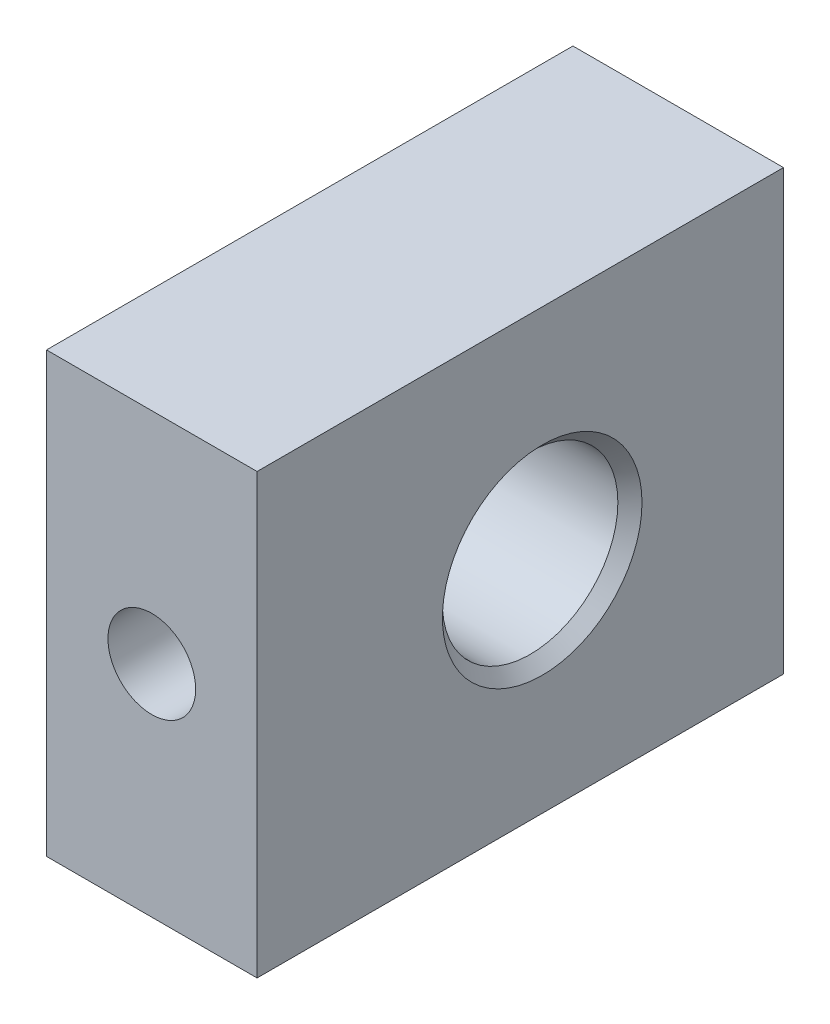
ISO-10303-21;
HEADER;
FILE_DESCRIPTION(('STEP AP214'),'2;1');
FILE_NAME('part.step','',(''),(''),'','','');
FILE_SCHEMA(('AUTOMOTIVE_DESIGN { 1 0 10303 214 1 1 1 1 }'));
ENDSEC;
DATA;
#1=APPLICATION_CONTEXT('core data for automotive mechanical design processes');
#2=APPLICATION_PROTOCOL_DEFINITION('international standard','automotive_design',2000,#1);
#3=PRODUCT_CONTEXT('',#1,'mechanical');
#4=PRODUCT('Part','Part','',(#3));
#5=PRODUCT_RELATED_PRODUCT_CATEGORY('part','',(#4));
#6=PRODUCT_DEFINITION_FORMATION('','',#4);
#7=PRODUCT_DEFINITION_CONTEXT('part definition',#1,'design');
#8=PRODUCT_DEFINITION('design','',#6,#7);
#9=PRODUCT_DEFINITION_SHAPE('','',#8);
#10=(LENGTH_UNIT() NAMED_UNIT(*) SI_UNIT(.MILLI.,.METRE.));
#11=(NAMED_UNIT(*) PLANE_ANGLE_UNIT() SI_UNIT($,.RADIAN.));
#12=(NAMED_UNIT(*) SI_UNIT($,.STERADIAN.) SOLID_ANGLE_UNIT());
#13=UNCERTAINTY_MEASURE_WITH_UNIT(LENGTH_MEASURE(1.E-05),#10,'distance_accuracy_value','');
#14=(GEOMETRIC_REPRESENTATION_CONTEXT(3) GLOBAL_UNCERTAINTY_ASSIGNED_CONTEXT((#13)) GLOBAL_UNIT_ASSIGNED_CONTEXT((#10,
#11,#12)) REPRESENTATION_CONTEXT('',''));
#15=CARTESIAN_POINT('',(0.,0.,0.));
#16=DIRECTION('',(0.,0.,1.));
#17=DIRECTION('',(1.,0.,0.));
#18=AXIS2_PLACEMENT_3D('',#15,#16,#17);
#19=CARTESIAN_POINT('',(2.4,-5.,12.));
#20=DIRECTION('',(-1.,0.,0.));
#21=DIRECTION('',(0.,0.,1.));
#22=AXIS2_PLACEMENT_3D('',#19,#20,#21);
#23=PLANE('',#22);
#24=CARTESIAN_POINT('',(2.4,0.,5.5));
#25=DIRECTION('',(1.,0.,0.));
#26=DIRECTION('',(0.,0.,-1.));
#27=AXIS2_PLACEMENT_3D('',#24,#25,#26);
#28=CIRCLE('',#27,2.275);
#29=CARTESIAN_POINT('',(2.4,0.,3.225));
#30=VERTEX_POINT('',#29);
#31=EDGE_CURVE('E113',#30,#30,#28,.T.);
#32=ORIENTED_EDGE('',*,*,#31,.F.);
#33=EDGE_LOOP('',(#32));
#34=FACE_BOUND('',#33,.T.);
#35=DIRECTION('',(0.,1.,0.));
#36=VECTOR('',#35,1.);
#37=CARTESIAN_POINT('',(2.4,-5.,0.));
#38=LINE('',#37,#36);
#39=CARTESIAN_POINT('',(2.4,-5.,0.));
#40=VERTEX_POINT('',#39);
#41=CARTESIAN_POINT('',(2.4,5.,0.));
#42=VERTEX_POINT('',#41);
#43=EDGE_CURVE('E94',#40,#42,#38,.T.);
#44=ORIENTED_EDGE('',*,*,#43,.T.);
#45=DIRECTION('',(0.,0.,-1.));
#46=VECTOR('',#45,1.);
#47=CARTESIAN_POINT('',(2.4,5.,12.));
#48=LINE('',#47,#46);
#49=CARTESIAN_POINT('',(2.4,5.,12.));
#50=VERTEX_POINT('',#49);
#51=EDGE_CURVE('E11',#50,#42,#48,.T.);
#52=ORIENTED_EDGE('',*,*,#51,.F.);
#53=DIRECTION('',(0.,1.,0.));
#54=VECTOR('',#53,1.);
#55=CARTESIAN_POINT('',(2.4,-5.,12.));
#56=LINE('',#55,#54);
#57=CARTESIAN_POINT('',(2.4,-5.,12.));
#58=VERTEX_POINT('',#57);
#59=EDGE_CURVE('E82',#58,#50,#56,.T.);
#60=ORIENTED_EDGE('',*,*,#59,.F.);
#61=DIRECTION('',(0.,0.,-1.));
#62=VECTOR('',#61,1.);
#63=CARTESIAN_POINT('',(2.4,-5.,12.));
#64=LINE('',#63,#62);
#65=EDGE_CURVE('E90',#58,#40,#64,.T.);
#66=ORIENTED_EDGE('',*,*,#65,.T.);
#67=EDGE_LOOP('',(#44,#52,#60,#66));
#68=FACE_BOUND('',#67,.T.);
#69=ADVANCED_FACE('F31',(#34,#68),#23,.F.);
#70=CARTESIAN_POINT('',(-2.4,5.,12.));
#71=DIRECTION('',(0.,-1.,0.));
#72=DIRECTION('',(0.,0.,-1.));
#73=AXIS2_PLACEMENT_3D('',#70,#71,#72);
#74=PLANE('',#73);
#75=DIRECTION('',(-1.,0.,0.));
#76=VECTOR('',#75,1.);
#77=CARTESIAN_POINT('',(-2.4,5.,0.));
#78=LINE('',#77,#76);
#79=CARTESIAN_POINT('',(-2.4,5.,0.));
#80=VERTEX_POINT('',#79);
#81=EDGE_CURVE('E86',#42,#80,#78,.T.);
#82=ORIENTED_EDGE('',*,*,#81,.T.);
#83=DIRECTION('',(0.,0.,-1.));
#84=VECTOR('',#83,1.);
#85=CARTESIAN_POINT('',(-2.4,5.,12.));
#86=LINE('',#85,#84);
#87=CARTESIAN_POINT('',(-2.4,5.,12.));
#88=VERTEX_POINT('',#87);
#89=EDGE_CURVE('E39',#88,#80,#86,.T.);
#90=ORIENTED_EDGE('',*,*,#89,.F.);
#91=DIRECTION('',(-1.,0.,0.));
#92=VECTOR('',#91,1.);
#93=CARTESIAN_POINT('',(-2.4,5.,12.));
#94=LINE('',#93,#92);
#95=EDGE_CURVE('E77',#50,#88,#94,.T.);
#96=ORIENTED_EDGE('',*,*,#95,.F.);
#97=ORIENTED_EDGE('',*,*,#51,.T.);
#98=EDGE_LOOP('',(#82,#90,#96,#97));
#99=FACE_BOUND('',#98,.T.);
#100=ADVANCED_FACE('F85',(#99),#74,.F.);
#101=CARTESIAN_POINT('',(-2.4,-5.,12.));
#102=DIRECTION('',(1.,0.,0.));
#103=DIRECTION('',(0.,0.,-1.));
#104=AXIS2_PLACEMENT_3D('',#101,#102,#103);
#105=PLANE('',#104);
#106=CARTESIAN_POINT('',(-2.4,0.,5.5));
#107=DIRECTION('',(1.,0.,0.));
#108=DIRECTION('',(0.,0.,-1.));
#109=AXIS2_PLACEMENT_3D('',#106,#107,#108);
#110=CIRCLE('',#109,2.275);
#111=CARTESIAN_POINT('',(-2.4,0.,3.225));
#112=VERTEX_POINT('',#111);
#113=EDGE_CURVE('E116',#112,#112,#110,.T.);
#114=ORIENTED_EDGE('',*,*,#113,.T.);
#115=EDGE_LOOP('',(#114));
#116=FACE_BOUND('',#115,.T.);
#117=DIRECTION('',(0.,-1.,0.));
#118=VECTOR('',#117,1.);
#119=CARTESIAN_POINT('',(-2.4,-5.,0.));
#120=LINE('',#119,#118);
#121=CARTESIAN_POINT('',(-2.4,-5.,0.));
#122=VERTEX_POINT('',#121);
#123=EDGE_CURVE('E64',#80,#122,#120,.T.);
#124=ORIENTED_EDGE('',*,*,#123,.T.);
#125=DIRECTION('',(0.,0.,-1.));
#126=VECTOR('',#125,1.);
#127=CARTESIAN_POINT('',(-2.4,-5.,12.));
#128=LINE('',#127,#126);
#129=CARTESIAN_POINT('',(-2.4,-5.,12.));
#130=VERTEX_POINT('',#129);
#131=EDGE_CURVE('E87',#130,#122,#128,.T.);
#132=ORIENTED_EDGE('',*,*,#131,.F.);
#133=DIRECTION('',(0.,-1.,0.));
#134=VECTOR('',#133,1.);
#135=CARTESIAN_POINT('',(-2.4,-5.,12.));
#136=LINE('',#135,#134);
#137=EDGE_CURVE('E80',#88,#130,#136,.T.);
#138=ORIENTED_EDGE('',*,*,#137,.F.);
#139=ORIENTED_EDGE('',*,*,#89,.T.);
#140=EDGE_LOOP('',(#124,#132,#138,#139));
#141=FACE_BOUND('',#140,.T.);
#142=ADVANCED_FACE('F88',(#116,#141),#105,.F.);
#143=CARTESIAN_POINT('',(-2.4,-5.,12.));
#144=DIRECTION('',(0.,1.,0.));
#145=DIRECTION('',(0.,0.,1.));
#146=AXIS2_PLACEMENT_3D('',#143,#144,#145);
#147=PLANE('',#146);
#148=DIRECTION('',(1.,0.,0.));
#149=VECTOR('',#148,1.);
#150=CARTESIAN_POINT('',(-2.4,-5.,0.));
#151=LINE('',#150,#149);
#152=EDGE_CURVE('E70',#122,#40,#151,.T.);
#153=ORIENTED_EDGE('',*,*,#152,.T.);
#154=ORIENTED_EDGE('',*,*,#65,.F.);
#155=DIRECTION('',(1.,0.,0.));
#156=VECTOR('',#155,1.);
#157=CARTESIAN_POINT('',(-2.4,-5.,12.));
#158=LINE('',#157,#156);
#159=EDGE_CURVE('E47',#130,#58,#158,.T.);
#160=ORIENTED_EDGE('',*,*,#159,.F.);
#161=ORIENTED_EDGE('',*,*,#131,.T.);
#162=EDGE_LOOP('',(#153,#154,#160,#161));
#163=FACE_BOUND('',#162,.T.);
#164=ADVANCED_FACE('F102',(#163),#147,.F.);
#165=CARTESIAN_POINT('',(2.4,5.,12.));
#166=DIRECTION('',(0.,0.,-1.));
#167=DIRECTION('',(-1.,0.,0.));
#168=AXIS2_PLACEMENT_3D('',#165,#166,#167);
#169=PLANE('',#168);
#170=CARTESIAN_POINT('',(0.,0.,12.));
#171=DIRECTION('',(0.,0.,1.));
#172=DIRECTION('',(1.,0.,0.));
#173=AXIS2_PLACEMENT_3D('',#170,#171,#172);
#174=CIRCLE('',#173,1.);
#175=CARTESIAN_POINT('',(1.,0.,12.));
#176=VERTEX_POINT('',#175);
#177=EDGE_CURVE('E119',#176,#176,#174,.T.);
#178=ORIENTED_EDGE('',*,*,#177,.F.);
#179=EDGE_LOOP('',(#178));
#180=FACE_BOUND('',#179,.T.);
#181=ORIENTED_EDGE('',*,*,#59,.T.);
#182=ORIENTED_EDGE('',*,*,#95,.T.);
#183=ORIENTED_EDGE('',*,*,#137,.T.);
#184=ORIENTED_EDGE('',*,*,#159,.T.);
#185=EDGE_LOOP('',(#181,#182,#183,#184));
#186=FACE_BOUND('',#185,.T.);
#187=ADVANCED_FACE('F78',(#180,#186),#169,.F.);
#188=CARTESIAN_POINT('',(2.4,5.,0.));
#189=DIRECTION('',(0.,0.,-1.));
#190=DIRECTION('',(-1.,0.,0.));
#191=AXIS2_PLACEMENT_3D('',#188,#189,#190);
#192=PLANE('',#191);
#193=ORIENTED_EDGE('',*,*,#43,.F.);
#194=ORIENTED_EDGE('',*,*,#152,.F.);
#195=ORIENTED_EDGE('',*,*,#123,.F.);
#196=ORIENTED_EDGE('',*,*,#81,.F.);
#197=EDGE_LOOP('',(#193,#194,#195,#196));
#198=FACE_BOUND('',#197,.T.);
#199=ADVANCED_FACE('F105',(#198),#192,.T.);
#200=CARTESIAN_POINT('',(-2.125,0.,5.5));
#201=DIRECTION('',(-1.,0.,0.));
#202=DIRECTION('',(0.,0.,1.));
#203=AXIS2_PLACEMENT_3D('',#200,#201,#202);
#204=CONICAL_SURFACE('',#203,2.,0.785398163397448);
#205=ORIENTED_EDGE('',*,*,#113,.F.);
#206=EDGE_LOOP('',(#205));
#207=FACE_BOUND('',#206,.T.);
#208=CARTESIAN_POINT('',(-2.125,0.,5.5));
#209=DIRECTION('',(1.,0.,0.));
#210=DIRECTION('',(0.,0.,-1.));
#211=AXIS2_PLACEMENT_3D('',#208,#209,#210);
#212=CIRCLE('',#211,2.);
#213=CARTESIAN_POINT('',(-2.125,0.,3.5));
#214=VERTEX_POINT('',#213);
#215=EDGE_CURVE('E97',#214,#214,#212,.T.);
#216=ORIENTED_EDGE('',*,*,#215,.T.);
#217=EDGE_LOOP('',(#216));
#218=FACE_BOUND('',#217,.T.);
#219=ADVANCED_FACE('F141',(#207,#218),#204,.F.);
#220=CARTESIAN_POINT('',(2.4,0.,5.5));
#221=DIRECTION('',(1.,0.,0.));
#222=DIRECTION('',(0.,0.,-1.));
#223=AXIS2_PLACEMENT_3D('',#220,#221,#222);
#224=CYLINDRICAL_SURFACE('',#223,1.99999999999999);
#225=CARTESIAN_POINT('',(1.,0.,7.49999999999999));
#226=CARTESIAN_POINT('',(0.999996697680499,-0.0525719629529865,7.4999971340415));
#227=CARTESIAN_POINT('',(0.995829926878325,-0.105206599698033,7.49790491019517));
#228=CARTESIAN_POINT('',(0.979347119659082,-0.208920235268425,7.48974156037395));
#229=CARTESIAN_POINT('',(0.96701560700235,-0.259996086713504,7.48366287828983));
#230=CARTESIAN_POINT('',(0.934806191383206,-0.358933544880574,7.46816279403311));
#231=CARTESIAN_POINT('',(0.914957615751988,-0.40680680293918,7.4587543917752));
#232=CARTESIAN_POINT('',(0.86842937863506,-0.498472616806565,7.43745776515778));
#233=CARTESIAN_POINT('',(0.841750255751148,-0.54226549399005,7.42556973633529));
#234=CARTESIAN_POINT('',(0.780482750514702,-0.627507817761919,7.39956258258056));
#235=CARTESIAN_POINT('',(0.745513520760358,-0.668655211122112,7.38535199127535));
#236=CARTESIAN_POINT('',(0.669478520752967,-0.744779444866977,7.35659970246744));
#237=CARTESIAN_POINT('',(0.62840814822756,-0.779751583106766,7.34205776209034));
#238=CARTESIAN_POINT('',(0.537516650476618,-0.845252000450278,7.31298951197346));
#239=CARTESIAN_POINT('',(0.487263901654087,-0.875225335551637,7.29855186970131));
#240=CARTESIAN_POINT('',(0.381632664013785,-0.926168226890695,7.2728597877232));
#241=CARTESIAN_POINT('',(0.326257871277251,-0.947144214966334,7.26160307606989));
#242=CARTESIAN_POINT('',(0.215334894578077,-0.978132442188589,7.24457867037808));
#243=CARTESIAN_POINT('',(0.159995547932606,-0.988725857080441,7.23852271583713));
#244=CARTESIAN_POINT('',(0.0480211622205232,-1.00042699330885,7.23181889948527));
#245=CARTESIAN_POINT('',(-0.00861254087115467,-1.00154408837307,7.23116569343287));
#246=CARTESIAN_POINT('',(-0.114286024315368,-0.994687287172294,7.23510930257248));
#247=CARTESIAN_POINT('',(-0.16342403122305,-0.987784559536821,7.23908763662013));
#248=CARTESIAN_POINT('',(-0.259721909373042,-0.966939849056932,7.2507622873385));
#249=CARTESIAN_POINT('',(-0.306881145305315,-0.952995623897652,7.25845978831776));
#250=CARTESIAN_POINT('',(-0.399229132565659,-0.918209780386004,7.2768747641274));
#251=CARTESIAN_POINT('',(-0.444346398785788,-0.897215067115995,7.28765840663998));
#252=CARTESIAN_POINT('',(-0.530634292590007,-0.849041687668003,7.31103404281403));
#253=CARTESIAN_POINT('',(-0.571803135600088,-0.821860243812468,7.3236268478019));
#254=CARTESIAN_POINT('',(-0.654521252743226,-0.758066054912789,7.35113157903285));
#255=CARTESIAN_POINT('',(-0.695456873576157,-0.720694458369282,7.36613510236745));
#256=CARTESIAN_POINT('',(-0.770735418590901,-0.639555578741374,7.39547623300407));
#257=CARTESIAN_POINT('',(-0.805075192033882,-0.595785256574286,7.409813519588));
#258=CARTESIAN_POINT('',(-0.867685661029727,-0.500516505831849,7.43701987282963));
#259=CARTESIAN_POINT('',(-0.89560047244574,-0.448753591599409,7.44978984162007));
#260=CARTESIAN_POINT('',(-0.942097029043009,-0.340466215488798,7.47157881121241));
#261=CARTESIAN_POINT('',(-0.960686185015167,-0.283945576265277,7.48060078943552));
#262=CARTESIAN_POINT('',(-0.986475403716675,-0.172766491660702,7.49324333741435));
#263=CARTESIAN_POINT('',(-0.994491235746778,-0.118341530548325,7.49724938301311));
#264=CARTESIAN_POINT('',(-1.00146473113449,-0.00877959994935442,7.50073013459101));
#265=CARTESIAN_POINT('',(-1.00042668563948,0.0463570198699006,7.50020698721312));
#266=CARTESIAN_POINT('',(-0.989793311581246,0.151232971985993,7.4949119225344));
#267=CARTESIAN_POINT('',(-0.98086746726997,0.201059408049953,7.49047245688189));
#268=CARTESIAN_POINT('',(-0.955761928104915,0.298406892301916,7.47822171314818));
#269=CARTESIAN_POINT('',(-0.939581433546642,0.345927685690996,7.47041006334332));
#270=CARTESIAN_POINT('',(-0.900001533566828,0.438888608449665,7.45184251413669));
#271=CARTESIAN_POINT('',(-0.876408949883188,0.484230397006153,7.44100881769939));
#272=CARTESIAN_POINT('',(-0.822892464353959,0.57046136169892,7.41743974317108));
#273=CARTESIAN_POINT('',(-0.792965865406569,0.611348629775281,7.40470355565784));
#274=CARTESIAN_POINT('',(-0.724239574667127,0.691767689290652,7.37708221337464));
#275=CARTESIAN_POINT('',(-0.684857131546436,0.730772077824638,7.36210884848441));
#276=CARTESIAN_POINT('',(-0.600074848730697,0.801856321113239,7.33262391603874));
#277=CARTESIAN_POINT('',(-0.554670881183627,0.83393138569084,7.31811267381526));
#278=CARTESIAN_POINT('',(-0.45635634579969,0.891707914497695,7.29051192226067));
#279=CARTESIAN_POINT('',(-0.403188733791407,0.917025495878637,7.27752529663471));
#280=CARTESIAN_POINT('',(-0.29248993230748,0.958082826013802,7.25574072368125));
#281=CARTESIAN_POINT('',(-0.234964473498814,0.97383491588757,7.24693738240617));
#282=CARTESIAN_POINT('',(-0.123089777138553,0.993861687449679,7.23561501008666));
#283=CARTESIAN_POINT('',(-0.0689657465709656,0.999092996400865,7.2325738346049));
#284=CARTESIAN_POINT('',(0.039447067170727,1.00068915438079,7.23165354646174));
#285=CARTESIAN_POINT('',(0.0937357687394321,0.997057846624399,7.23377219627552));
#286=CARTESIAN_POINT('',(0.195483501532014,0.981926125592263,7.24237862050024));
#287=CARTESIAN_POINT('',(0.243100470144399,0.9712083143428,7.24843094482393));
#288=CARTESIAN_POINT('',(0.335808119424705,0.943175358224645,7.26371016187917));
#289=CARTESIAN_POINT('',(0.380897982091966,0.925858091159811,7.27293807569675));
#290=CARTESIAN_POINT('',(0.470624850986605,0.883815745300684,7.29428530364527));
#291=CARTESIAN_POINT('',(0.515027901829699,0.858671137816459,7.3065572239619));
#292=CARTESIAN_POINT('',(0.599274536180585,0.802150971636635,7.33235331634589));
#293=CARTESIAN_POINT('',(0.639115730518489,0.770772171238649,7.34587813794521));
#294=CARTESIAN_POINT('',(0.718141982357614,0.698203326664643,7.37462323159312));
#295=CARTESIAN_POINT('',(0.75665910236192,0.656284423010173,7.38984983311468));
#296=CARTESIAN_POINT('',(0.826262983423631,0.566154806220282,7.41877752255087));
#297=CARTESIAN_POINT('',(0.857345739426288,0.517940723256787,7.43247778608039));
#298=CARTESIAN_POINT('',(0.911236362762203,0.415931596819949,7.45698009585103));
#299=CARTESIAN_POINT('',(0.933984169411434,0.362099503934616,7.46776096562908));
#300=CARTESIAN_POINT('',(0.969808167918952,0.250742101294193,7.48501341363465));
#301=CARTESIAN_POINT('',(0.982911846829578,0.193227799623168,7.49149723372931));
#302=CARTESIAN_POINT('',(0.993897411075849,0.112601946483385,7.49695461909663));
#303=CARTESIAN_POINT('',(0.996182640863619,0.0901618794394999,7.49809365339201));
#304=CARTESIAN_POINT('',(0.999234665516806,0.0451517318071583,7.49961696977864));
#305=CARTESIAN_POINT('',(1.0000014184712,0.0225816476473817,7.50000123103763));
#306=CARTESIAN_POINT('',(1.,0.,7.49999999999999));
#307=B_SPLINE_CURVE_WITH_KNOTS('',3,(#225,#226,#227,#228,#229,#230,#231,#232,#233,#234,#235,
#236,#237,#238,#239,#240,#241,#242,#243,#244,#245,#246,#247,#248,#249,#250,#251,#252,#253,#254,
#255,#256,#257,#258,#259,#260,#261,#262,#263,#264,#265,#266,#267,#268,#269,#270,#271,#272,#273,
#274,#275,#276,#277,#278,#279,#280,#281,#282,#283,#284,#285,#286,#287,#288,#289,#290,#291,#292,
#293,#294,#295,#296,#297,#298,#299,#300,#301,#302,#303,#304,#305,#306),.UNSPECIFIED.,.T.,.F.,(4,
2,2,2,2,2,2,2,2,2,2,2,2,2,2,2,2,2,2,2,2,2,2,2,2,2,2,2,2,2,2,2,2,2,2,2,2,2,2,2,4),(0.,
0.157624257420293,0.315548149709198,0.472862155492298,0.630163760581567,0.796981758718088,
0.963926237654035,1.14381726430753,1.32357947898281,1.4925801214023,1.6614135732902,
1.81005712409321,1.95874803925678,2.11090240168487,2.26312521260222,2.43464941333878,
2.60625534598686,2.78583022214441,2.96526216912279,3.12983290471346,3.29432564511476,
3.44606906506122,3.59782921630931,3.75392856027898,3.91009450748339,4.08159610644419,
4.25321588615432,4.43314682159674,4.61284511940777,4.77529307498373,4.93767059860005,
5.08457930244183,5.23153528783678,5.38836456775614,5.54527561138958,5.72125242752498,
5.89732383376572,6.07464013662925,6.2514490862493,6.31915280137698,6.38685838514847),.UNSPECIFIED.);
#308=CARTESIAN_POINT('',(1.,0.,7.49999999999999));
#309=VERTEX_POINT('',#308);
#310=EDGE_CURVE('E122',#309,#309,#307,.T.);
#311=ORIENTED_EDGE('',*,*,#310,.F.);
#312=EDGE_LOOP('',(#311));
#313=FACE_BOUND('',#312,.T.);
#314=ORIENTED_EDGE('',*,*,#215,.F.);
#315=EDGE_LOOP('',(#314));
#316=FACE_BOUND('',#315,.T.);
#317=CARTESIAN_POINT('',(2.12499999999999,0.,5.5));
#318=DIRECTION('',(1.,0.,0.));
#319=DIRECTION('',(0.,0.,-1.));
#320=AXIS2_PLACEMENT_3D('',#317,#318,#319);
#321=CIRCLE('',#320,1.99999999999999);
#322=CARTESIAN_POINT('',(2.12499999999999,0.,3.50000000000001));
#323=VERTEX_POINT('',#322);
#324=EDGE_CURVE('E110',#323,#323,#321,.T.);
#325=ORIENTED_EDGE('',*,*,#324,.T.);
#326=EDGE_LOOP('',(#325));
#327=FACE_BOUND('',#326,.T.);
#328=ADVANCED_FACE('F137',(#313,#316,#327),#224,.F.);
#329=CARTESIAN_POINT('',(2.4,0.,5.5));
#330=DIRECTION('',(1.,0.,0.));
#331=DIRECTION('',(0.,0.,-1.));
#332=AXIS2_PLACEMENT_3D('',#329,#330,#331);
#333=CONICAL_SURFACE('',#332,2.275,0.785398163397445);
#334=ORIENTED_EDGE('',*,*,#324,.F.);
#335=EDGE_LOOP('',(#334));
#336=FACE_BOUND('',#335,.T.);
#337=ORIENTED_EDGE('',*,*,#31,.T.);
#338=EDGE_LOOP('',(#337));
#339=FACE_BOUND('',#338,.T.);
#340=ADVANCED_FACE('F133',(#336,#339),#333,.F.);
#341=CARTESIAN_POINT('',(0.,0.,-0.000999999999999265));
#342=DIRECTION('',(0.,0.,1.));
#343=DIRECTION('',(1.,0.,0.));
#344=AXIS2_PLACEMENT_3D('',#341,#342,#343);
#345=CYLINDRICAL_SURFACE('',#344,1.);
#346=ORIENTED_EDGE('',*,*,#177,.T.);
#347=EDGE_LOOP('',(#346));
#348=FACE_BOUND('',#347,.T.);
#349=ORIENTED_EDGE('',*,*,#310,.T.);
#350=EDGE_LOOP('',(#349));
#351=FACE_BOUND('',#350,.T.);
#352=ADVANCED_FACE('F128',(#348,#351),#345,.F.);
#353=CLOSED_SHELL('',(#69,#100,#142,#164,#187,#199,#219,#328,#340,#352));
#354=MANIFOLD_SOLID_BREP('B2',#353);
#355=ADVANCED_BREP_SHAPE_REPRESENTATION('',(#18,#354),#14);
#356=SHAPE_DEFINITION_REPRESENTATION(#9,#355);
ENDSEC;
END-ISO-10303-21;
